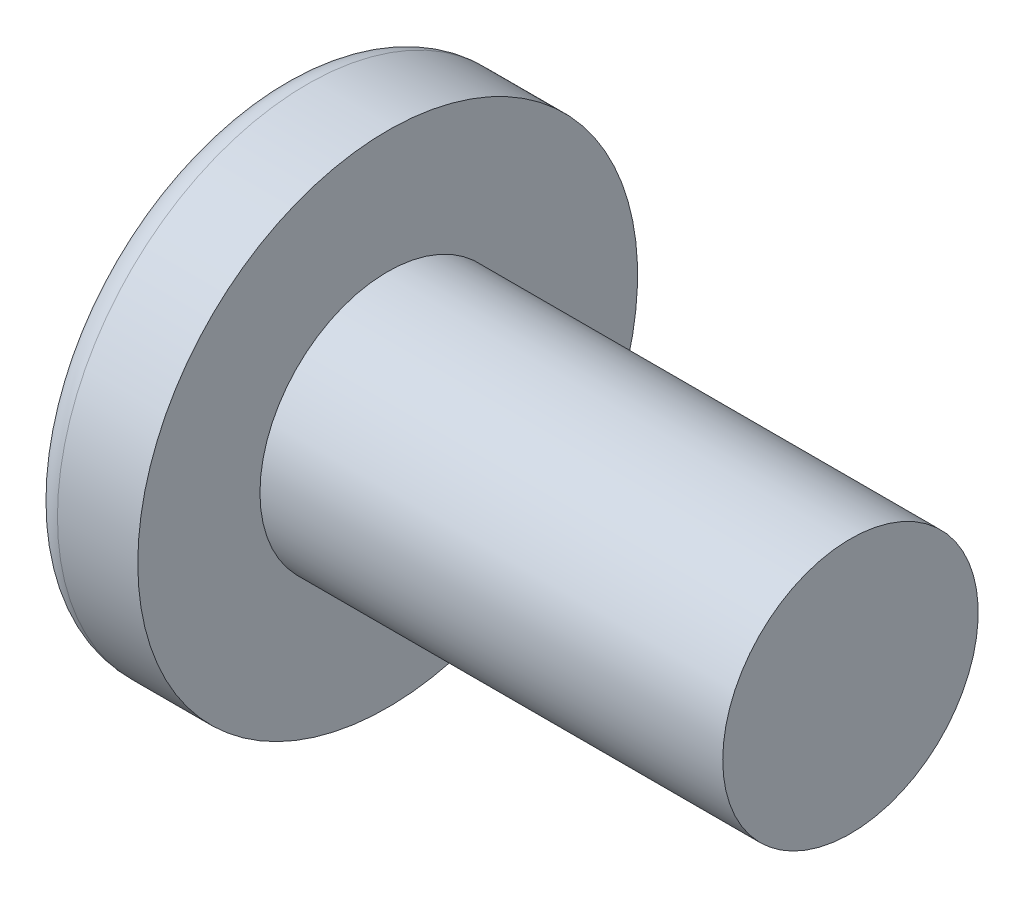
ISO-10303-21;
HEADER;
FILE_DESCRIPTION(('STEP AP214'),'2;1');
FILE_NAME('part.step','',(''),(''),'','','');
FILE_SCHEMA(('AUTOMOTIVE_DESIGN { 1 0 10303 214 1 1 1 1 }'));
ENDSEC;
DATA;
#1=APPLICATION_CONTEXT('core data for automotive mechanical design processes');
#2=APPLICATION_PROTOCOL_DEFINITION('international standard','automotive_design',2000,#1);
#3=PRODUCT_CONTEXT('',#1,'mechanical');
#4=PRODUCT('Part','Part','',(#3));
#5=PRODUCT_RELATED_PRODUCT_CATEGORY('part','',(#4));
#6=PRODUCT_DEFINITION_FORMATION('','',#4);
#7=PRODUCT_DEFINITION_CONTEXT('part definition',#1,'design');
#8=PRODUCT_DEFINITION('design','',#6,#7);
#9=PRODUCT_DEFINITION_SHAPE('','',#8);
#10=(LENGTH_UNIT() NAMED_UNIT(*) SI_UNIT(.MILLI.,.METRE.));
#11=(NAMED_UNIT(*) PLANE_ANGLE_UNIT() SI_UNIT($,.RADIAN.));
#12=(NAMED_UNIT(*) SI_UNIT($,.STERADIAN.) SOLID_ANGLE_UNIT());
#13=UNCERTAINTY_MEASURE_WITH_UNIT(LENGTH_MEASURE(1.E-05),#10,'distance_accuracy_value','');
#14=(GEOMETRIC_REPRESENTATION_CONTEXT(3) GLOBAL_UNCERTAINTY_ASSIGNED_CONTEXT((#13)) GLOBAL_UNIT_ASSIGNED_CONTEXT((#10,
#11,#12)) REPRESENTATION_CONTEXT('',''));
#15=CARTESIAN_POINT('',(0.,0.,0.));
#16=DIRECTION('',(0.,0.,1.));
#17=DIRECTION('',(1.,0.,0.));
#18=AXIS2_PLACEMENT_3D('',#15,#16,#17);
#19=CARTESIAN_POINT('',(5.60832,0.,0.));
#20=DIRECTION('',(-1.,0.,0.));
#21=DIRECTION('',(0.,1.,0.));
#22=AXIS2_PLACEMENT_3D('',#19,#20,#21);
#23=SPHERICAL_SURFACE('',#22,5.60832);
#24=CARTESIAN_POINT('',(1.05207992987385,0.,0.));
#25=DIRECTION('',(-1.,0.,0.));
#26=DIRECTION('',(0.,0.,1.));
#27=AXIS2_PLACEMENT_3D('',#24,#25,#26);
#28=CIRCLE('',#27,3.27015743440233);
#29=CARTESIAN_POINT('',(1.05207992987385,0.,3.27015743440233));
#30=VERTEX_POINT('',#29);
#31=EDGE_CURVE('E152',#30,#30,#28,.T.);
#32=ORIENTED_EDGE('',*,*,#31,.T.);
#33=EDGE_LOOP('',(#32));
#34=FACE_BOUND('',#33,.T.);
#35=CARTESIAN_POINT('',(5.60159094990761,-0.0698366279858894,0.));
#36=DIRECTION('',(-0.0959099751473922,-0.995390012340503,0.));
#37=DIRECTION('',(0.995390012340503,-0.0959099751473922,0.));
#38=AXIS2_PLACEMENT_3D('',#35,#36,#37);
#39=CIRCLE('',#38,5.60788113173562);
#40=CARTESIAN_POINT('',(0.363211504948026,0.43490305811698,1.93725306234732));
#41=VERTEX_POINT('',#40);
#42=CARTESIAN_POINT('',(0.0388806474754125,0.466153687613044,0.466153687613045));
#43=VERTEX_POINT('',#42);
#44=EDGE_CURVE('E183',#41,#43,#39,.T.);
#45=ORIENTED_EDGE('',*,*,#44,.F.);
#46=CARTESIAN_POINT('',(4.44845864059251,0.,-1.41392622861104));
#47=DIRECTION('',(0.634224045665226,0.,0.773149312810943));
#48=DIRECTION('',(0.773149312810943,0.,-0.634224045665226));
#49=AXIS2_PLACEMENT_3D('',#46,#47,#48);
#50=CIRCLE('',#49,5.30177210651299);
#51=CARTESIAN_POINT('',(0.363211504948024,-0.434903058116994,1.93725306234732));
#52=VERTEX_POINT('',#51);
#53=EDGE_CURVE('E148',#41,#52,#50,.T.);
#54=ORIENTED_EDGE('',*,*,#53,.T.);
#55=CARTESIAN_POINT('',(5.60159094990761,0.0698366279858886,0.));
#56=DIRECTION('',(-0.0959099751473919,0.995390012340503,0.));
#57=DIRECTION('',(-0.995390012340503,-0.0959099751473919,0.));
#58=AXIS2_PLACEMENT_3D('',#55,#56,#57);
#59=CIRCLE('',#58,5.60788113173562);
#60=CARTESIAN_POINT('',(0.0388806474754116,-0.466153687613047,0.466153687613045));
#61=VERTEX_POINT('',#60);
#62=EDGE_CURVE('E104',#61,#52,#59,.T.);
#63=ORIENTED_EDGE('',*,*,#62,.F.);
#64=CARTESIAN_POINT('',(5.60159094990761,0.,-0.0698366279858886));
#65=DIRECTION('',(-0.0959099751473919,0.,-0.995390012340503));
#66=DIRECTION('',(-0.995390012340503,0.,0.0959099751473919));
#67=AXIS2_PLACEMENT_3D('',#64,#65,#66);
#68=CIRCLE('',#67,5.60788113173562);
#69=CARTESIAN_POINT('',(0.363211504948022,-1.93725306234733,0.434903058116986));
#70=VERTEX_POINT('',#69);
#71=EDGE_CURVE('E129',#70,#61,#68,.T.);
#72=ORIENTED_EDGE('',*,*,#71,.F.);
#73=CARTESIAN_POINT('',(4.4484586405925,1.41392622861104,0.));
#74=DIRECTION('',(0.634224045665226,-0.773149312810943,0.));
#75=DIRECTION('',(0.773149312810943,0.634224045665226,0.));
#76=AXIS2_PLACEMENT_3D('',#73,#74,#75);
#77=CIRCLE('',#76,5.30177210651299);
#78=CARTESIAN_POINT('',(0.363211504948023,-1.93725306234732,-0.434903058116987));
#79=VERTEX_POINT('',#78);
#80=EDGE_CURVE('E137',#70,#79,#77,.T.);
#81=ORIENTED_EDGE('',*,*,#80,.T.);
#82=CARTESIAN_POINT('',(5.60159094990761,0.,0.0698366279858894));
#83=DIRECTION('',(-0.0959099751473922,0.,0.995390012340503));
#84=DIRECTION('',(0.995390012340503,0.,0.0959099751473922));
#85=AXIS2_PLACEMENT_3D('',#82,#83,#84);
#86=CIRCLE('',#85,5.60788113173562);
#87=CARTESIAN_POINT('',(0.0388806474754108,-0.466153687613044,-0.466153687613046));
#88=VERTEX_POINT('',#87);
#89=EDGE_CURVE('E47',#88,#79,#86,.T.);
#90=ORIENTED_EDGE('',*,*,#89,.F.);
#91=CARTESIAN_POINT('',(0.363211504948023,-0.43490305811698,-1.93725306234733));
#92=VERTEX_POINT('',#91);
#93=EDGE_CURVE('E190',#92,#88,#59,.T.);
#94=ORIENTED_EDGE('',*,*,#93,.F.);
#95=CARTESIAN_POINT('',(4.44845864059251,0.,1.41392622861104));
#96=DIRECTION('',(0.634224045665226,0.,-0.773149312810943));
#97=DIRECTION('',(-0.773149312810943,0.,-0.634224045665226));
#98=AXIS2_PLACEMENT_3D('',#95,#96,#97);
#99=CIRCLE('',#98,5.30177210651299);
#100=CARTESIAN_POINT('',(0.363211504948025,0.434903058116994,-1.93725306234732));
#101=VERTEX_POINT('',#100);
#102=EDGE_CURVE('E130',#92,#101,#99,.T.);
#103=ORIENTED_EDGE('',*,*,#102,.T.);
#104=CARTESIAN_POINT('',(0.0388806474754116,0.466153687613048,-0.466153687613046));
#105=VERTEX_POINT('',#104);
#106=EDGE_CURVE('E178',#105,#101,#39,.T.);
#107=ORIENTED_EDGE('',*,*,#106,.F.);
#108=CARTESIAN_POINT('',(0.363211504948027,1.93725306234732,-0.434903058116987));
#109=VERTEX_POINT('',#108);
#110=EDGE_CURVE('E40',#109,#105,#86,.T.);
#111=ORIENTED_EDGE('',*,*,#110,.F.);
#112=CARTESIAN_POINT('',(4.44845864059251,-1.41392622861104,0.));
#113=DIRECTION('',(0.634224045665226,0.773149312810943,0.));
#114=DIRECTION('',(-0.773149312810943,0.634224045665226,0.));
#115=AXIS2_PLACEMENT_3D('',#112,#113,#114);
#116=CIRCLE('',#115,5.30177210651299);
#117=CARTESIAN_POINT('',(0.363211504948027,1.93725306234732,0.434903058116987));
#118=VERTEX_POINT('',#117);
#119=EDGE_CURVE('E11',#109,#118,#116,.T.);
#120=ORIENTED_EDGE('',*,*,#119,.T.);
#121=EDGE_CURVE('E166',#43,#118,#68,.T.);
#122=ORIENTED_EDGE('',*,*,#121,.F.);
#123=EDGE_LOOP('',(#45,#54,#63,#72,#81,#90,#94,#103,#107,#111,#120,#122));
#124=FACE_BOUND('',#123,.T.);
#125=ADVANCED_FACE('F32',(#34,#124),#23,.T.);
#126=CARTESIAN_POINT('',(2.72481523809524,0.,-0.207352698412698));
#127=DIRECTION('',(-0.0959099751473922,0.,0.995390012340503));
#128=DIRECTION('',(0.995390012340503,0.,0.0959099751473922));
#129=AXIS2_PLACEMENT_3D('',#126,#127,#128);
#130=PLANE('',#129);
#131=ORIENTED_EDGE('',*,*,#110,.T.);
#132=DIRECTION('',(0.990843198401238,-0.0954718706792863,0.0954718706792859));
#133=VECTOR('',#132,1.);
#134=CARTESIAN_POINT('',(2.74443031685369,0.205462703844827,-0.205462703844826));
#135=LINE('',#134,#133);
#136=CARTESIAN_POINT('',(2.4384,0.234950000000001,-0.234949999999999));
#137=VERTEX_POINT('',#136);
#138=EDGE_CURVE('E172',#105,#137,#135,.T.);
#139=ORIENTED_EDGE('',*,*,#138,.T.);
#140=DIRECTION('',(0.771012836595292,-0.632471467519576,0.0742902993594422));
#141=VECTOR('',#140,1.);
#142=CARTESIAN_POINT('',(0.,2.2352,-0.4699));
#143=LINE('',#142,#141);
#144=EDGE_CURVE('E153',#109,#137,#143,.T.);
#145=ORIENTED_EDGE('',*,*,#144,.F.);
#146=EDGE_LOOP('',(#131,#139,#145));
#147=FACE_BOUND('',#146,.T.);
#148=ADVANCED_FACE('F171',(#147),#130,.T.);
#149=DIRECTION('',(0.771012836595292,0.632471467519576,0.0742902993594422));
#150=VECTOR('',#149,1.);
#151=CARTESIAN_POINT('',(0.,-2.2352,-0.4699));
#152=LINE('',#151,#150);
#153=CARTESIAN_POINT('',(2.4384,-0.23495,-0.23495));
#154=VERTEX_POINT('',#153);
#155=EDGE_CURVE('E138',#79,#154,#152,.T.);
#156=ORIENTED_EDGE('',*,*,#155,.T.);
#157=DIRECTION('',(-0.990843198401238,-0.0954718706792853,-0.0954718706792859));
#158=VECTOR('',#157,1.);
#159=CARTESIAN_POINT('',(2.74443031685369,-0.205462703844826,-0.205462703844826));
#160=LINE('',#159,#158);
#161=EDGE_CURVE('E193',#154,#88,#160,.T.);
#162=ORIENTED_EDGE('',*,*,#161,.T.);
#163=ORIENTED_EDGE('',*,*,#89,.T.);
#164=EDGE_LOOP('',(#156,#162,#163));
#165=FACE_BOUND('',#164,.T.);
#166=ADVANCED_FACE('F208',(#165),#130,.T.);
#167=CARTESIAN_POINT('',(2.72481523809524,0.,0.207352698412698));
#168=DIRECTION('',(-0.0959099751473919,0.,-0.995390012340503));
#169=DIRECTION('',(-0.995390012340503,0.,0.0959099751473919));
#170=AXIS2_PLACEMENT_3D('',#167,#168,#169);
#171=PLANE('',#170);
#172=DIRECTION('',(0.771012836595292,-0.632471467519576,-0.0742902993594421));
#173=VECTOR('',#172,1.);
#174=CARTESIAN_POINT('',(0.,2.2352,0.469899999999999));
#175=LINE('',#174,#173);
#176=CARTESIAN_POINT('',(2.4384,0.23495,0.23495));
#177=VERTEX_POINT('',#176);
#178=EDGE_CURVE('E209',#118,#177,#175,.T.);
#179=ORIENTED_EDGE('',*,*,#178,.T.);
#180=DIRECTION('',(-0.990843198401238,0.0954718706792856,0.0954718706792857));
#181=VECTOR('',#180,1.);
#182=CARTESIAN_POINT('',(2.74443031685369,0.205462703844826,0.205462703844826));
#183=LINE('',#182,#181);
#184=EDGE_CURVE('E187',#177,#43,#183,.T.);
#185=ORIENTED_EDGE('',*,*,#184,.T.);
#186=ORIENTED_EDGE('',*,*,#121,.T.);
#187=EDGE_LOOP('',(#179,#185,#186));
#188=FACE_BOUND('',#187,.T.);
#189=ADVANCED_FACE('F213',(#188),#171,.T.);
#190=ORIENTED_EDGE('',*,*,#71,.T.);
#191=DIRECTION('',(0.990843198401238,0.095471870679286,-0.0954718706792857));
#192=VECTOR('',#191,1.);
#193=CARTESIAN_POINT('',(2.74443031685369,-0.205462703844827,0.205462703844826));
#194=LINE('',#193,#192);
#195=CARTESIAN_POINT('',(2.4384,-0.234950000000001,0.234949999999999));
#196=VERTEX_POINT('',#195);
#197=EDGE_CURVE('E102',#61,#196,#194,.T.);
#198=ORIENTED_EDGE('',*,*,#197,.T.);
#199=DIRECTION('',(0.771012836595292,0.632471467519576,-0.0742902993594419));
#200=VECTOR('',#199,1.);
#201=CARTESIAN_POINT('',(0.,-2.2352,0.469899999999999));
#202=LINE('',#201,#200);
#203=EDGE_CURVE('E127',#70,#196,#202,.T.);
#204=ORIENTED_EDGE('',*,*,#203,.F.);
#205=EDGE_LOOP('',(#190,#198,#204));
#206=FACE_BOUND('',#205,.T.);
#207=ADVANCED_FACE('F126',(#206),#171,.T.);
#208=CARTESIAN_POINT('',(-25.4,0.,0.));
#209=DIRECTION('',(-1.,0.,0.));
#210=DIRECTION('',(0.,0.,1.));
#211=AXIS2_PLACEMENT_3D('',#208,#209,#210);
#212=CYLINDRICAL_SURFACE('',#211,1.7526);
#213=CARTESIAN_POINT('',(8.8138,0.,0.));
#214=DIRECTION('',(-1.,0.,0.));
#215=DIRECTION('',(0.,0.,1.));
#216=AXIS2_PLACEMENT_3D('',#213,#214,#215);
#217=CIRCLE('',#216,1.7526);
#218=CARTESIAN_POINT('',(8.8138,0.,1.7526));
#219=VERTEX_POINT('',#218);
#220=EDGE_CURVE('E149',#219,#219,#217,.T.);
#221=ORIENTED_EDGE('',*,*,#220,.T.);
#222=EDGE_LOOP('',(#221));
#223=FACE_BOUND('',#222,.T.);
#224=CARTESIAN_POINT('',(2.4638,0.,0.));
#225=DIRECTION('',(-1.,0.,0.));
#226=DIRECTION('',(0.,0.,1.));
#227=AXIS2_PLACEMENT_3D('',#224,#225,#226);
#228=CIRCLE('',#227,1.7526);
#229=CARTESIAN_POINT('',(2.4638,0.,1.7526));
#230=VERTEX_POINT('',#229);
#231=EDGE_CURVE('E162',#230,#230,#228,.T.);
#232=ORIENTED_EDGE('',*,*,#231,.F.);
#233=EDGE_LOOP('',(#232));
#234=FACE_BOUND('',#233,.T.);
#235=ADVANCED_FACE('F34',(#223,#234),#212,.T.);
#236=CARTESIAN_POINT('',(2.4638,1.7526,0.));
#237=DIRECTION('',(-1.,0.,0.));
#238=DIRECTION('',(0.,0.,1.));
#239=AXIS2_PLACEMENT_3D('',#236,#237,#238);
#240=PLANE('',#239);
#241=CARTESIAN_POINT('',(2.4638,0.,0.));
#242=DIRECTION('',(-1.,0.,0.));
#243=DIRECTION('',(0.,0.,1.));
#244=AXIS2_PLACEMENT_3D('',#241,#242,#243);
#245=CIRCLE('',#244,3.429);
#246=CARTESIAN_POINT('',(2.4638,0.,3.429));
#247=VERTEX_POINT('',#246);
#248=EDGE_CURVE('E159',#247,#247,#245,.T.);
#249=ORIENTED_EDGE('',*,*,#248,.F.);
#250=EDGE_LOOP('',(#249));
#251=FACE_BOUND('',#250,.T.);
#252=ORIENTED_EDGE('',*,*,#231,.T.);
#253=EDGE_LOOP('',(#252));
#254=FACE_BOUND('',#253,.T.);
#255=ADVANCED_FACE('F241',(#251,#254),#240,.F.);
#256=CARTESIAN_POINT('',(-25.4,0.,0.));
#257=DIRECTION('',(-1.,0.,0.));
#258=DIRECTION('',(0.,0.,1.));
#259=AXIS2_PLACEMENT_3D('',#256,#257,#258);
#260=CYLINDRICAL_SURFACE('',#259,3.429);
#261=ORIENTED_EDGE('',*,*,#248,.T.);
#262=EDGE_LOOP('',(#261));
#263=FACE_BOUND('',#262,.T.);
#264=CARTESIAN_POINT('',(1.3616071085509,0.,0.));
#265=DIRECTION('',(-1.,0.,0.));
#266=DIRECTION('',(0.,0.,1.));
#267=AXIS2_PLACEMENT_3D('',#264,#265,#266);
#268=CIRCLE('',#267,3.429);
#269=CARTESIAN_POINT('',(1.3616071085509,0.,3.429));
#270=VERTEX_POINT('',#269);
#271=EDGE_CURVE('E156',#270,#270,#268,.T.);
#272=ORIENTED_EDGE('',*,*,#271,.F.);
#273=EDGE_LOOP('',(#272));
#274=FACE_BOUND('',#273,.T.);
#275=ADVANCED_FACE('F238',(#263,#274),#260,.T.);
#276=CARTESIAN_POINT('',(1.3616071085509,0.,0.));
#277=DIRECTION('',(-1.,0.,0.));
#278=DIRECTION('',(0.,0.,1.));
#279=AXIS2_PLACEMENT_3D('',#276,#277,#278);
#280=TOROIDAL_SURFACE('',#279,3.048,0.381);
#281=ORIENTED_EDGE('',*,*,#271,.T.);
#282=EDGE_LOOP('',(#281));
#283=FACE_BOUND('',#282,.T.);
#284=ORIENTED_EDGE('',*,*,#31,.F.);
#285=EDGE_LOOP('',(#284));
#286=FACE_BOUND('',#285,.T.);
#287=ADVANCED_FACE('F235',(#283,#286),#280,.T.);
#288=CARTESIAN_POINT('',(8.8138,1.7526,0.));
#289=DIRECTION('',(1.,0.,0.));
#290=DIRECTION('',(0.,0.,-1.));
#291=AXIS2_PLACEMENT_3D('',#288,#289,#290);
#292=PLANE('',#291);
#293=ORIENTED_EDGE('',*,*,#220,.F.);
#294=EDGE_LOOP('',(#293));
#295=FACE_BOUND('',#294,.T.);
#296=ADVANCED_FACE('F233',(#295),#292,.T.);
#297=CARTESIAN_POINT('',(0.,2.2352,0.469899999999999));
#298=DIRECTION('',(0.634224045665226,0.773149312810943,0.));
#299=DIRECTION('',(-0.773149312810943,0.634224045665226,0.));
#300=AXIS2_PLACEMENT_3D('',#297,#298,#299);
#301=PLANE('',#300);
#302=ORIENTED_EDGE('',*,*,#144,.T.);
#303=DIRECTION('',(0.,0.,-1.));
#304=VECTOR('',#303,1.);
#305=CARTESIAN_POINT('',(2.4384,0.23495,0.23495));
#306=LINE('',#305,#304);
#307=EDGE_CURVE('E120',#177,#137,#306,.T.);
#308=ORIENTED_EDGE('',*,*,#307,.F.);
#309=ORIENTED_EDGE('',*,*,#178,.F.);
#310=ORIENTED_EDGE('',*,*,#119,.F.);
#311=EDGE_LOOP('',(#302,#308,#309,#310));
#312=FACE_BOUND('',#311,.T.);
#313=ADVANCED_FACE('F212',(#312),#301,.F.);
#314=CARTESIAN_POINT('',(2.4384,-0.23495,-0.23495));
#315=DIRECTION('',(0.634224045665226,-0.773149312810943,0.));
#316=DIRECTION('',(0.773149312810943,0.634224045665226,0.));
#317=AXIS2_PLACEMENT_3D('',#314,#315,#316);
#318=PLANE('',#317);
#319=ORIENTED_EDGE('',*,*,#203,.T.);
#320=DIRECTION('',(0.,0.,1.));
#321=VECTOR('',#320,1.);
#322=CARTESIAN_POINT('',(2.4384,-0.23495,-0.23495));
#323=LINE('',#322,#321);
#324=EDGE_CURVE('E119',#154,#196,#323,.T.);
#325=ORIENTED_EDGE('',*,*,#324,.F.);
#326=ORIENTED_EDGE('',*,*,#155,.F.);
#327=ORIENTED_EDGE('',*,*,#80,.F.);
#328=EDGE_LOOP('',(#319,#325,#326,#327));
#329=FACE_BOUND('',#328,.T.);
#330=ADVANCED_FACE('F134',(#329),#318,.F.);
#331=CARTESIAN_POINT('',(2.4384,0.23495,-0.23495));
#332=DIRECTION('',(-1.,0.,0.));
#333=DIRECTION('',(0.,0.,1.));
#334=AXIS2_PLACEMENT_3D('',#331,#332,#333);
#335=PLANE('',#334);
#336=DIRECTION('',(0.,1.,0.));
#337=VECTOR('',#336,1.);
#338=CARTESIAN_POINT('',(2.4384,-0.23495,-0.23495));
#339=LINE('',#338,#337);
#340=EDGE_CURVE('E142',#154,#137,#339,.T.);
#341=ORIENTED_EDGE('',*,*,#340,.F.);
#342=ORIENTED_EDGE('',*,*,#324,.T.);
#343=DIRECTION('',(0.,-1.,0.));
#344=VECTOR('',#343,1.);
#345=CARTESIAN_POINT('',(2.4384,0.23495,0.23495));
#346=LINE('',#345,#344);
#347=EDGE_CURVE('E111',#177,#196,#346,.T.);
#348=ORIENTED_EDGE('',*,*,#347,.F.);
#349=ORIENTED_EDGE('',*,*,#307,.T.);
#350=EDGE_LOOP('',(#341,#342,#348,#349));
#351=FACE_BOUND('',#350,.T.);
#352=ADVANCED_FACE('F140',(#351),#335,.T.);
#353=CARTESIAN_POINT('',(2.4384,0.234950000000001,-0.234949999999999));
#354=DIRECTION('',(0.634224045665226,0.,-0.773149312810943));
#355=DIRECTION('',(0.773149312810943,0.,0.634224045665226));
#356=AXIS2_PLACEMENT_3D('',#353,#354,#355);
#357=PLANE('',#356);
#358=DIRECTION('',(0.771012836595292,0.0742902993594397,0.632471467519576));
#359=VECTOR('',#358,1.);
#360=CARTESIAN_POINT('',(0.,-0.469899999999991,-2.2352));
#361=LINE('',#360,#359);
#362=EDGE_CURVE('E198',#92,#154,#361,.T.);
#363=ORIENTED_EDGE('',*,*,#362,.T.);
#364=ORIENTED_EDGE('',*,*,#340,.T.);
#365=DIRECTION('',(0.771012836595292,-0.0742902993594444,0.632471467519575));
#366=VECTOR('',#365,1.);
#367=CARTESIAN_POINT('',(0.,0.469900000000008,-2.2352));
#368=LINE('',#367,#366);
#369=EDGE_CURVE('E108',#101,#137,#368,.T.);
#370=ORIENTED_EDGE('',*,*,#369,.F.);
#371=ORIENTED_EDGE('',*,*,#102,.F.);
#372=EDGE_LOOP('',(#363,#364,#370,#371));
#373=FACE_BOUND('',#372,.T.);
#374=ADVANCED_FACE('F203',(#373),#357,.F.);
#375=CARTESIAN_POINT('',(2.72481523809524,-0.207352698412698,0.));
#376=DIRECTION('',(-0.0959099751473919,0.995390012340503,0.));
#377=DIRECTION('',(-0.995390012340503,-0.0959099751473919,0.));
#378=AXIS2_PLACEMENT_3D('',#375,#376,#377);
#379=PLANE('',#378);
#380=ORIENTED_EDGE('',*,*,#93,.T.);
#381=ORIENTED_EDGE('',*,*,#161,.F.);
#382=ORIENTED_EDGE('',*,*,#362,.F.);
#383=EDGE_LOOP('',(#380,#381,#382));
#384=FACE_BOUND('',#383,.T.);
#385=ADVANCED_FACE('F207',(#384),#379,.T.);
#386=CARTESIAN_POINT('',(2.72481523809524,0.207352698412698,0.));
#387=DIRECTION('',(-0.0959099751473922,-0.995390012340503,0.));
#388=DIRECTION('',(0.995390012340503,-0.0959099751473922,0.));
#389=AXIS2_PLACEMENT_3D('',#386,#387,#388);
#390=PLANE('',#389);
#391=ORIENTED_EDGE('',*,*,#106,.T.);
#392=ORIENTED_EDGE('',*,*,#369,.T.);
#393=ORIENTED_EDGE('',*,*,#138,.F.);
#394=EDGE_LOOP('',(#391,#392,#393));
#395=FACE_BOUND('',#394,.T.);
#396=ADVANCED_FACE('F201',(#395),#390,.T.);
#397=CARTESIAN_POINT('',(0.,-0.469900000000007,2.2352));
#398=DIRECTION('',(0.634224045665226,0.,0.773149312810943));
#399=DIRECTION('',(-0.773149312810943,0.,0.634224045665226));
#400=AXIS2_PLACEMENT_3D('',#397,#398,#399);
#401=PLANE('',#400);
#402=DIRECTION('',(0.771012836595292,-0.07429029935944,-0.632471467519576));
#403=VECTOR('',#402,1.);
#404=CARTESIAN_POINT('',(0.,0.469899999999992,2.2352));
#405=LINE('',#404,#403);
#406=EDGE_CURVE('E107',#41,#177,#405,.T.);
#407=ORIENTED_EDGE('',*,*,#406,.T.);
#408=ORIENTED_EDGE('',*,*,#347,.T.);
#409=DIRECTION('',(0.771012836595292,0.0742902993594443,-0.632471467519575));
#410=VECTOR('',#409,1.);
#411=CARTESIAN_POINT('',(0.,-0.469900000000007,2.2352));
#412=LINE('',#411,#410);
#413=EDGE_CURVE('E98',#52,#196,#412,.T.);
#414=ORIENTED_EDGE('',*,*,#413,.F.);
#415=ORIENTED_EDGE('',*,*,#53,.F.);
#416=EDGE_LOOP('',(#407,#408,#414,#415));
#417=FACE_BOUND('',#416,.T.);
#418=ADVANCED_FACE('F112',(#417),#401,.F.);
#419=ORIENTED_EDGE('',*,*,#44,.T.);
#420=ORIENTED_EDGE('',*,*,#184,.F.);
#421=ORIENTED_EDGE('',*,*,#406,.F.);
#422=EDGE_LOOP('',(#419,#420,#421));
#423=FACE_BOUND('',#422,.T.);
#424=ADVANCED_FACE('F214',(#423),#390,.T.);
#425=ORIENTED_EDGE('',*,*,#62,.T.);
#426=ORIENTED_EDGE('',*,*,#413,.T.);
#427=ORIENTED_EDGE('',*,*,#197,.F.);
#428=EDGE_LOOP('',(#425,#426,#427));
#429=FACE_BOUND('',#428,.T.);
#430=ADVANCED_FACE('F100',(#429),#379,.T.);
#431=CLOSED_SHELL('',(#125,#148,#166,#189,#207,#235,#255,#275,#287,#296,#313,#330,#352,#374,
#385,#396,#418,#424,#430));
#432=MANIFOLD_SOLID_BREP('B2',#431);
#433=ADVANCED_BREP_SHAPE_REPRESENTATION('',(#18,#432),#14);
#434=SHAPE_DEFINITION_REPRESENTATION(#9,#433);
ENDSEC;
END-ISO-10303-21;
